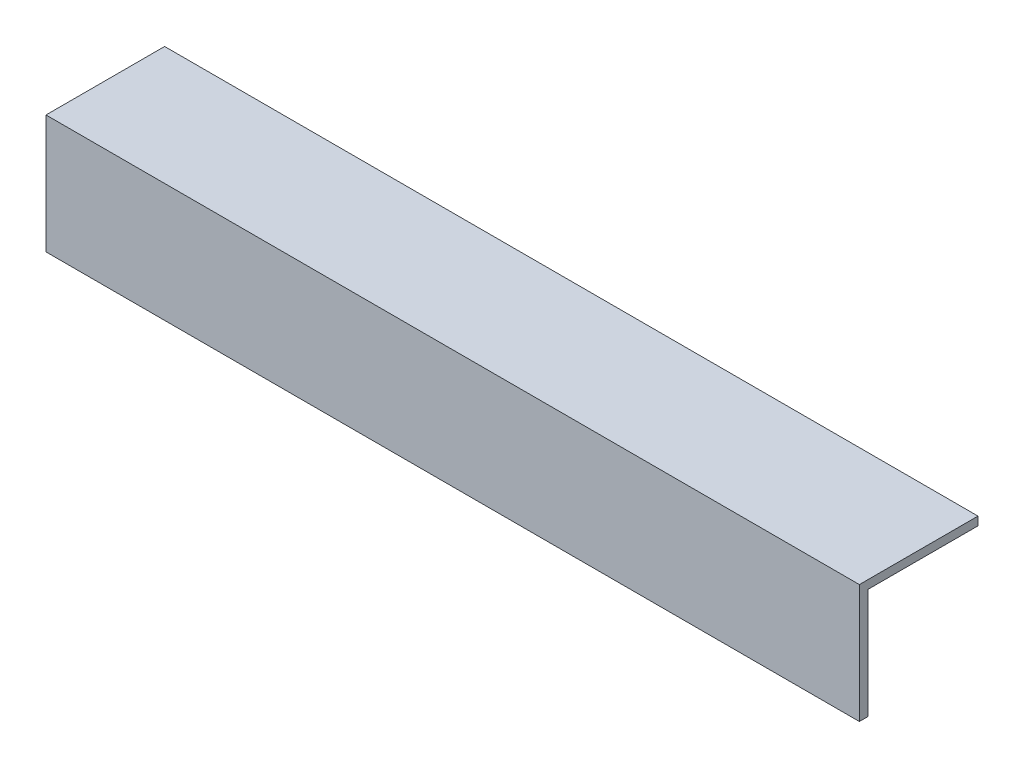
ISO-10303-21;
HEADER;
FILE_DESCRIPTION(('STEP AP214'),'2;1');
FILE_NAME('part.step','',(''),(''),'','','');
FILE_SCHEMA(('AUTOMOTIVE_DESIGN { 1 0 10303 214 1 1 1 1 }'));
ENDSEC;
DATA;
#1=APPLICATION_CONTEXT('core data for automotive mechanical design processes');
#2=APPLICATION_PROTOCOL_DEFINITION('international standard','automotive_design',2000,#1);
#3=PRODUCT_CONTEXT('',#1,'mechanical');
#4=PRODUCT('Part','Part','',(#3));
#5=PRODUCT_RELATED_PRODUCT_CATEGORY('part','',(#4));
#6=PRODUCT_DEFINITION_FORMATION('','',#4);
#7=PRODUCT_DEFINITION_CONTEXT('part definition',#1,'design');
#8=PRODUCT_DEFINITION('design','',#6,#7);
#9=PRODUCT_DEFINITION_SHAPE('','',#8);
#10=(LENGTH_UNIT() NAMED_UNIT(*) SI_UNIT(.MILLI.,.METRE.));
#11=(NAMED_UNIT(*) PLANE_ANGLE_UNIT() SI_UNIT($,.RADIAN.));
#12=(NAMED_UNIT(*) SI_UNIT($,.STERADIAN.) SOLID_ANGLE_UNIT());
#13=UNCERTAINTY_MEASURE_WITH_UNIT(LENGTH_MEASURE(1.E-05),#10,'distance_accuracy_value','');
#14=(GEOMETRIC_REPRESENTATION_CONTEXT(3) GLOBAL_UNCERTAINTY_ASSIGNED_CONTEXT((#13)) GLOBAL_UNIT_ASSIGNED_CONTEXT((#10,
#11,#12)) REPRESENTATION_CONTEXT('',''));
#15=CARTESIAN_POINT('',(0.,0.,0.));
#16=DIRECTION('',(0.,0.,1.));
#17=DIRECTION('',(1.,0.,0.));
#18=AXIS2_PLACEMENT_3D('',#15,#16,#17);
#19=CARTESIAN_POINT('',(-152.4,-44.45,-3.175));
#20=DIRECTION('',(0.,0.,-1.));
#21=DIRECTION('',(-1.,0.,0.));
#22=AXIS2_PLACEMENT_3D('',#19,#20,#21);
#23=PLANE('',#22);
#24=DIRECTION('',(1.,0.,0.));
#25=VECTOR('',#24,1.);
#26=CARTESIAN_POINT('',(-152.4,-44.45,-3.175));
#27=LINE('',#26,#25);
#28=CARTESIAN_POINT('',(-152.4,-44.45,-3.175));
#29=VERTEX_POINT('',#28);
#30=CARTESIAN_POINT('',(152.4,-44.45,-3.175));
#31=VERTEX_POINT('',#30);
#32=EDGE_CURVE('E72',#29,#31,#27,.T.);
#33=ORIENTED_EDGE('',*,*,#32,.F.);
#34=DIRECTION('',(0.,1.,0.));
#35=VECTOR('',#34,1.);
#36=CARTESIAN_POINT('',(-152.4,0.,-3.175));
#37=LINE('',#36,#35);
#38=CARTESIAN_POINT('',(-152.4,-3.175,-3.175));
#39=VERTEX_POINT('',#38);
#40=EDGE_CURVE('E104',#29,#39,#37,.T.);
#41=ORIENTED_EDGE('',*,*,#40,.T.);
#42=DIRECTION('',(1.,0.,0.));
#43=VECTOR('',#42,1.);
#44=CARTESIAN_POINT('',(-152.4,-3.175,-3.175));
#45=LINE('',#44,#43);
#46=CARTESIAN_POINT('',(152.4,-3.175,-3.175));
#47=VERTEX_POINT('',#46);
#48=EDGE_CURVE('E20',#47,#39,#45,.F.);
#49=ORIENTED_EDGE('',*,*,#48,.F.);
#50=DIRECTION('',(0.,1.,0.));
#51=VECTOR('',#50,1.);
#52=CARTESIAN_POINT('',(152.4,0.,-3.175));
#53=LINE('',#52,#51);
#54=EDGE_CURVE('E83',#31,#47,#53,.T.);
#55=ORIENTED_EDGE('',*,*,#54,.F.);
#56=EDGE_LOOP('',(#33,#41,#49,#55));
#57=FACE_BOUND('',#56,.T.);
#58=ADVANCED_FACE('F17',(#57),#23,.T.);
#59=CARTESIAN_POINT('',(-152.4,-3.175,-3.175));
#60=DIRECTION('',(0.,-1.,0.));
#61=DIRECTION('',(0.,0.,-1.));
#62=AXIS2_PLACEMENT_3D('',#59,#60,#61);
#63=PLANE('',#62);
#64=ORIENTED_EDGE('',*,*,#48,.T.);
#65=DIRECTION('',(0.,0.,-1.));
#66=VECTOR('',#65,1.);
#67=CARTESIAN_POINT('',(-152.4,-3.175,0.));
#68=LINE('',#67,#66);
#69=CARTESIAN_POINT('',(-152.4,-3.175,-44.45));
#70=VERTEX_POINT('',#69);
#71=EDGE_CURVE('E101',#39,#70,#68,.T.);
#72=ORIENTED_EDGE('',*,*,#71,.T.);
#73=DIRECTION('',(-1.,0.,0.));
#74=VECTOR('',#73,1.);
#75=CARTESIAN_POINT('',(-152.4,-3.175,-44.45));
#76=LINE('',#75,#74);
#77=CARTESIAN_POINT('',(152.4,-3.175,-44.45));
#78=VERTEX_POINT('',#77);
#79=EDGE_CURVE('E80',#78,#70,#76,.T.);
#80=ORIENTED_EDGE('',*,*,#79,.F.);
#81=DIRECTION('',(0.,0.,-1.));
#82=VECTOR('',#81,1.);
#83=CARTESIAN_POINT('',(152.4,-3.175,0.));
#84=LINE('',#83,#82);
#85=EDGE_CURVE('E86',#47,#78,#84,.T.);
#86=ORIENTED_EDGE('',*,*,#85,.F.);
#87=EDGE_LOOP('',(#64,#72,#80,#86));
#88=FACE_BOUND('',#87,.T.);
#89=ADVANCED_FACE('F100',(#88),#63,.T.);
#90=CARTESIAN_POINT('',(-152.4,-3.175,-44.45));
#91=DIRECTION('',(0.,0.,-1.));
#92=DIRECTION('',(-1.,0.,0.));
#93=AXIS2_PLACEMENT_3D('',#90,#91,#92);
#94=PLANE('',#93);
#95=ORIENTED_EDGE('',*,*,#79,.T.);
#96=DIRECTION('',(0.,1.,0.));
#97=VECTOR('',#96,1.);
#98=CARTESIAN_POINT('',(-152.4,0.,-44.45));
#99=LINE('',#98,#97);
#100=CARTESIAN_POINT('',(-152.4,0.,-44.45));
#101=VERTEX_POINT('',#100);
#102=EDGE_CURVE('E105',#70,#101,#99,.T.);
#103=ORIENTED_EDGE('',*,*,#102,.T.);
#104=DIRECTION('',(1.,0.,0.));
#105=VECTOR('',#104,1.);
#106=CARTESIAN_POINT('',(-152.4,0.,-44.45));
#107=LINE('',#106,#105);
#108=CARTESIAN_POINT('',(152.4,0.,-44.45));
#109=VERTEX_POINT('',#108);
#110=EDGE_CURVE('E112',#109,#101,#107,.F.);
#111=ORIENTED_EDGE('',*,*,#110,.F.);
#112=DIRECTION('',(0.,1.,0.));
#113=VECTOR('',#112,1.);
#114=CARTESIAN_POINT('',(152.4,0.,-44.45));
#115=LINE('',#114,#113);
#116=EDGE_CURVE('E117',#78,#109,#115,.T.);
#117=ORIENTED_EDGE('',*,*,#116,.F.);
#118=EDGE_LOOP('',(#95,#103,#111,#117));
#119=FACE_BOUND('',#118,.T.);
#120=ADVANCED_FACE('F119',(#119),#94,.T.);
#121=CARTESIAN_POINT('',(-152.4,-44.45,0.));
#122=DIRECTION('',(0.,-1.,0.));
#123=DIRECTION('',(0.,0.,-1.));
#124=AXIS2_PLACEMENT_3D('',#121,#122,#123);
#125=PLANE('',#124);
#126=DIRECTION('',(1.,0.,0.));
#127=VECTOR('',#126,1.);
#128=CARTESIAN_POINT('',(-152.4,-44.45,0.));
#129=LINE('',#128,#127);
#130=CARTESIAN_POINT('',(-152.4,-44.45,0.));
#131=VERTEX_POINT('',#130);
#132=CARTESIAN_POINT('',(152.4,-44.45,0.));
#133=VERTEX_POINT('',#132);
#134=EDGE_CURVE('E125',#131,#133,#129,.T.);
#135=ORIENTED_EDGE('',*,*,#134,.F.);
#136=DIRECTION('',(0.,0.,-1.));
#137=VECTOR('',#136,1.);
#138=CARTESIAN_POINT('',(-152.4,-44.45,0.));
#139=LINE('',#138,#137);
#140=EDGE_CURVE('E78',#131,#29,#139,.T.);
#141=ORIENTED_EDGE('',*,*,#140,.T.);
#142=ORIENTED_EDGE('',*,*,#32,.T.);
#143=DIRECTION('',(0.,0.,-1.));
#144=VECTOR('',#143,1.);
#145=CARTESIAN_POINT('',(152.4,-44.45,0.));
#146=LINE('',#145,#144);
#147=EDGE_CURVE('E75',#133,#31,#146,.T.);
#148=ORIENTED_EDGE('',*,*,#147,.F.);
#149=EDGE_LOOP('',(#135,#141,#142,#148));
#150=FACE_BOUND('',#149,.T.);
#151=ADVANCED_FACE('F73',(#150),#125,.T.);
#152=CARTESIAN_POINT('',(152.4,0.,0.));
#153=DIRECTION('',(1.,0.,0.));
#154=DIRECTION('',(0.,0.,-1.));
#155=AXIS2_PLACEMENT_3D('',#152,#153,#154);
#156=PLANE('',#155);
#157=DIRECTION('',(0.,0.,1.));
#158=VECTOR('',#157,1.);
#159=CARTESIAN_POINT('',(152.4,0.,-44.45));
#160=LINE('',#159,#158);
#161=CARTESIAN_POINT('',(152.4,0.,0.));
#162=VERTEX_POINT('',#161);
#163=EDGE_CURVE('E114',#162,#109,#160,.F.);
#164=ORIENTED_EDGE('',*,*,#163,.F.);
#165=DIRECTION('',(0.,1.,0.));
#166=VECTOR('',#165,1.);
#167=CARTESIAN_POINT('',(152.4,0.,0.));
#168=LINE('',#167,#166);
#169=EDGE_CURVE('E90',#133,#162,#168,.T.);
#170=ORIENTED_EDGE('',*,*,#169,.F.);
#171=ORIENTED_EDGE('',*,*,#147,.T.);
#172=ORIENTED_EDGE('',*,*,#54,.T.);
#173=ORIENTED_EDGE('',*,*,#85,.T.);
#174=ORIENTED_EDGE('',*,*,#116,.T.);
#175=EDGE_LOOP('',(#164,#170,#171,#172,#173,#174));
#176=FACE_BOUND('',#175,.T.);
#177=ADVANCED_FACE('F88',(#176),#156,.T.);
#178=CARTESIAN_POINT('',(-152.4,0.,-44.45));
#179=DIRECTION('',(0.,1.,0.));
#180=DIRECTION('',(0.,0.,1.));
#181=AXIS2_PLACEMENT_3D('',#178,#179,#180);
#182=PLANE('',#181);
#183=ORIENTED_EDGE('',*,*,#110,.T.);
#184=DIRECTION('',(0.,0.,-1.));
#185=VECTOR('',#184,1.);
#186=CARTESIAN_POINT('',(-152.4,0.,0.));
#187=LINE('',#186,#185);
#188=CARTESIAN_POINT('',(-152.4,0.,0.));
#189=VERTEX_POINT('',#188);
#190=EDGE_CURVE('E35',#101,#189,#187,.F.);
#191=ORIENTED_EDGE('',*,*,#190,.T.);
#192=DIRECTION('',(1.,0.,0.));
#193=VECTOR('',#192,1.);
#194=CARTESIAN_POINT('',(-152.4,0.,0.));
#195=LINE('',#194,#193);
#196=EDGE_CURVE('E26',#162,#189,#195,.F.);
#197=ORIENTED_EDGE('',*,*,#196,.F.);
#198=ORIENTED_EDGE('',*,*,#163,.T.);
#199=EDGE_LOOP('',(#183,#191,#197,#198));
#200=FACE_BOUND('',#199,.T.);
#201=ADVANCED_FACE('F120',(#200),#182,.T.);
#202=CARTESIAN_POINT('',(-152.4,0.,0.));
#203=DIRECTION('',(1.,0.,0.));
#204=DIRECTION('',(0.,0.,-1.));
#205=AXIS2_PLACEMENT_3D('',#202,#203,#204);
#206=PLANE('',#205);
#207=ORIENTED_EDGE('',*,*,#102,.F.);
#208=ORIENTED_EDGE('',*,*,#71,.F.);
#209=ORIENTED_EDGE('',*,*,#40,.F.);
#210=ORIENTED_EDGE('',*,*,#140,.F.);
#211=DIRECTION('',(0.,1.,0.));
#212=VECTOR('',#211,1.);
#213=CARTESIAN_POINT('',(-152.4,0.,0.));
#214=LINE('',#213,#212);
#215=EDGE_CURVE('E11',#189,#131,#214,.F.);
#216=ORIENTED_EDGE('',*,*,#215,.F.);
#217=ORIENTED_EDGE('',*,*,#190,.F.);
#218=EDGE_LOOP('',(#207,#208,#209,#210,#216,#217));
#219=FACE_BOUND('',#218,.T.);
#220=ADVANCED_FACE('F103',(#219),#206,.F.);
#221=CARTESIAN_POINT('',(-152.4,0.,0.));
#222=DIRECTION('',(0.,0.,1.));
#223=DIRECTION('',(1.,0.,0.));
#224=AXIS2_PLACEMENT_3D('',#221,#222,#223);
#225=PLANE('',#224);
#226=ORIENTED_EDGE('',*,*,#196,.T.);
#227=ORIENTED_EDGE('',*,*,#215,.T.);
#228=ORIENTED_EDGE('',*,*,#134,.T.);
#229=ORIENTED_EDGE('',*,*,#169,.T.);
#230=EDGE_LOOP('',(#226,#227,#228,#229));
#231=FACE_BOUND('',#230,.T.);
#232=ADVANCED_FACE('F124',(#231),#225,.T.);
#233=CLOSED_SHELL('',(#58,#89,#120,#151,#177,#201,#220,#232));
#234=MANIFOLD_SOLID_BREP('B1',#233);
#235=ADVANCED_BREP_SHAPE_REPRESENTATION('',(#18,#234),#14);
#236=SHAPE_DEFINITION_REPRESENTATION(#9,#235);
ENDSEC;
END-ISO-10303-21;
